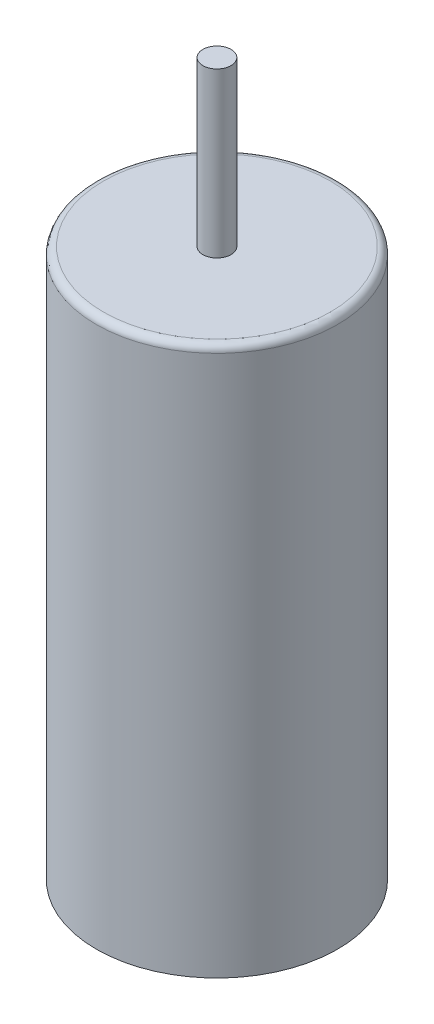
ISO-10303-21;
HEADER;
FILE_DESCRIPTION(('STEP AP214'),'2;1');
FILE_NAME('part.step','',(''),(''),'','','');
FILE_SCHEMA(('AUTOMOTIVE_DESIGN { 1 0 10303 214 1 1 1 1 }'));
ENDSEC;
DATA;
#1=APPLICATION_CONTEXT('core data for automotive mechanical design processes');
#2=APPLICATION_PROTOCOL_DEFINITION('international standard','automotive_design',2000,#1);
#3=PRODUCT_CONTEXT('',#1,'mechanical');
#4=PRODUCT('Part','Part','',(#3));
#5=PRODUCT_RELATED_PRODUCT_CATEGORY('part','',(#4));
#6=PRODUCT_DEFINITION_FORMATION('','',#4);
#7=PRODUCT_DEFINITION_CONTEXT('part definition',#1,'design');
#8=PRODUCT_DEFINITION('design','',#6,#7);
#9=PRODUCT_DEFINITION_SHAPE('','',#8);
#10=(LENGTH_UNIT() NAMED_UNIT(*) SI_UNIT(.MILLI.,.METRE.));
#11=(NAMED_UNIT(*) PLANE_ANGLE_UNIT() SI_UNIT($,.RADIAN.));
#12=(NAMED_UNIT(*) SI_UNIT($,.STERADIAN.) SOLID_ANGLE_UNIT());
#13=UNCERTAINTY_MEASURE_WITH_UNIT(LENGTH_MEASURE(1.E-05),#10,'distance_accuracy_value','');
#14=(GEOMETRIC_REPRESENTATION_CONTEXT(3) GLOBAL_UNCERTAINTY_ASSIGNED_CONTEXT((#13)) GLOBAL_UNIT_ASSIGNED_CONTEXT((#10,
#11,#12)) REPRESENTATION_CONTEXT('',''));
#15=CARTESIAN_POINT('',(0.,0.,0.));
#16=DIRECTION('',(0.,0.,1.));
#17=DIRECTION('',(1.,0.,0.));
#18=AXIS2_PLACEMENT_3D('',#15,#16,#17);
#19=CARTESIAN_POINT('',(0.,9.652,0.));
#20=DIRECTION('',(0.,-1.,0.));
#21=DIRECTION('',(0.,0.,-1.));
#22=AXIS2_PLACEMENT_3D('',#19,#20,#21);
#23=CYLINDRICAL_SURFACE('',#22,4.25);
#24=CARTESIAN_POINT('',(0.,9.398,0.));
#25=DIRECTION('',(0.,1.,0.));
#26=DIRECTION('',(0.,0.,1.));
#27=AXIS2_PLACEMENT_3D('',#24,#25,#26);
#28=CIRCLE('',#27,4.25);
#29=CARTESIAN_POINT('',(0.,9.398,4.25));
#30=VERTEX_POINT('',#29);
#31=EDGE_CURVE('E10',#30,#30,#28,.F.);
#32=ORIENTED_EDGE('',*,*,#31,.T.);
#33=EDGE_LOOP('',(#32));
#34=FACE_BOUND('',#33,.T.);
#35=CARTESIAN_POINT('',(0.,-9.652,0.));
#36=DIRECTION('',(0.,1.,0.));
#37=DIRECTION('',(0.,0.,1.));
#38=AXIS2_PLACEMENT_3D('',#35,#36,#37);
#39=CIRCLE('',#38,4.25);
#40=CARTESIAN_POINT('',(0.,-9.652,4.25));
#41=VERTEX_POINT('',#40);
#42=EDGE_CURVE('E46',#41,#41,#39,.T.);
#43=ORIENTED_EDGE('',*,*,#42,.T.);
#44=EDGE_LOOP('',(#43));
#45=FACE_BOUND('',#44,.T.);
#46=ADVANCED_FACE('F35',(#34,#45),#23,.T.);
#47=CARTESIAN_POINT('',(0.,9.652,0.));
#48=DIRECTION('',(0.,1.,0.));
#49=DIRECTION('',(0.,0.,1.));
#50=AXIS2_PLACEMENT_3D('',#47,#48,#49);
#51=PLANE('',#50);
#52=CARTESIAN_POINT('',(0.,9.652,0.));
#53=DIRECTION('',(0.,1.,0.));
#54=DIRECTION('',(0.,0.,1.));
#55=AXIS2_PLACEMENT_3D('',#52,#53,#54);
#56=CIRCLE('',#55,3.996);
#57=CARTESIAN_POINT('',(0.,9.652,3.996));
#58=VERTEX_POINT('',#57);
#59=EDGE_CURVE('E42',#58,#58,#56,.T.);
#60=ORIENTED_EDGE('',*,*,#59,.T.);
#61=EDGE_LOOP('',(#60));
#62=FACE_BOUND('',#61,.T.);
#63=CARTESIAN_POINT('',(0.,9.652,0.));
#64=DIRECTION('',(0.,1.,0.));
#65=DIRECTION('',(0.,0.,1.));
#66=AXIS2_PLACEMENT_3D('',#63,#64,#65);
#67=CIRCLE('',#66,0.4953);
#68=CARTESIAN_POINT('',(0.,9.652,0.4953));
#69=VERTEX_POINT('',#68);
#70=EDGE_CURVE('E53',#69,#69,#67,.T.);
#71=ORIENTED_EDGE('',*,*,#70,.F.);
#72=EDGE_LOOP('',(#71));
#73=FACE_BOUND('',#72,.T.);
#74=ADVANCED_FACE('F68',(#62,#73),#51,.T.);
#75=CARTESIAN_POINT('',(0.,-9.652,0.));
#76=DIRECTION('',(0.,1.,0.));
#77=DIRECTION('',(0.,0.,1.));
#78=AXIS2_PLACEMENT_3D('',#75,#76,#77);
#79=PLANE('',#78);
#80=ORIENTED_EDGE('',*,*,#42,.F.);
#81=EDGE_LOOP('',(#80));
#82=FACE_BOUND('',#81,.T.);
#83=ADVANCED_FACE('F64',(#82),#79,.F.);
#84=CARTESIAN_POINT('',(0.,15.4178,0.));
#85=DIRECTION('',(0.,-1.,0.));
#86=DIRECTION('',(0.,0.,-1.));
#87=AXIS2_PLACEMENT_3D('',#84,#85,#86);
#88=CYLINDRICAL_SURFACE('',#87,0.4953);
#89=CARTESIAN_POINT('',(0.,15.4178,0.));
#90=DIRECTION('',(0.,1.,0.));
#91=DIRECTION('',(0.,0.,1.));
#92=AXIS2_PLACEMENT_3D('',#89,#90,#91);
#93=CIRCLE('',#92,0.4953);
#94=CARTESIAN_POINT('',(0.,15.4178,0.4953));
#95=VERTEX_POINT('',#94);
#96=EDGE_CURVE('E50',#95,#95,#93,.T.);
#97=ORIENTED_EDGE('',*,*,#96,.F.);
#98=EDGE_LOOP('',(#97));
#99=FACE_BOUND('',#98,.T.);
#100=ORIENTED_EDGE('',*,*,#70,.T.);
#101=EDGE_LOOP('',(#100));
#102=FACE_BOUND('',#101,.T.);
#103=ADVANCED_FACE('F61',(#99,#102),#88,.T.);
#104=CARTESIAN_POINT('',(0.,15.4178,0.));
#105=DIRECTION('',(0.,1.,0.));
#106=DIRECTION('',(0.,0.,1.));
#107=AXIS2_PLACEMENT_3D('',#104,#105,#106);
#108=PLANE('',#107);
#109=ORIENTED_EDGE('',*,*,#96,.T.);
#110=EDGE_LOOP('',(#109));
#111=FACE_BOUND('',#110,.T.);
#112=ADVANCED_FACE('F59',(#111),#108,.T.);
#113=CARTESIAN_POINT('',(0.,9.398,0.));
#114=DIRECTION('',(0.,1.,0.));
#115=DIRECTION('',(0.,0.,1.));
#116=AXIS2_PLACEMENT_3D('',#113,#114,#115);
#117=TOROIDAL_SURFACE('',#116,3.996,0.254);
#118=ORIENTED_EDGE('',*,*,#31,.F.);
#119=EDGE_LOOP('',(#118));
#120=FACE_BOUND('',#119,.T.);
#121=ORIENTED_EDGE('',*,*,#59,.F.);
#122=EDGE_LOOP('',(#121));
#123=FACE_BOUND('',#122,.T.);
#124=ADVANCED_FACE('F37',(#120,#123),#117,.T.);
#125=CLOSED_SHELL('',(#46,#74,#83,#103,#112,#124));
#126=MANIFOLD_SOLID_BREP('B2',#125);
#127=ADVANCED_BREP_SHAPE_REPRESENTATION('',(#18,#126),#14);
#128=SHAPE_DEFINITION_REPRESENTATION(#9,#127);
ENDSEC;
END-ISO-10303-21;
